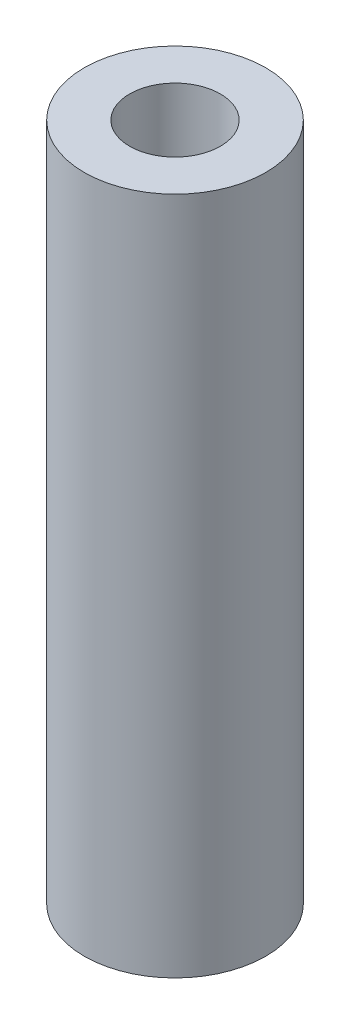
ISO-10303-21;
HEADER;
FILE_DESCRIPTION(('STEP AP214'),'2;1');
FILE_NAME('part.step','',(''),(''),'','','');
FILE_SCHEMA(('AUTOMOTIVE_DESIGN { 1 0 10303 214 1 1 1 1 }'));
ENDSEC;
DATA;
#1=APPLICATION_CONTEXT('core data for automotive mechanical design processes');
#2=APPLICATION_PROTOCOL_DEFINITION('international standard','automotive_design',2000,#1);
#3=PRODUCT_CONTEXT('',#1,'mechanical');
#4=PRODUCT('Part','Part','',(#3));
#5=PRODUCT_RELATED_PRODUCT_CATEGORY('part','',(#4));
#6=PRODUCT_DEFINITION_FORMATION('','',#4);
#7=PRODUCT_DEFINITION_CONTEXT('part definition',#1,'design');
#8=PRODUCT_DEFINITION('design','',#6,#7);
#9=PRODUCT_DEFINITION_SHAPE('','',#8);
#10=(LENGTH_UNIT() NAMED_UNIT(*) SI_UNIT(.MILLI.,.METRE.));
#11=(NAMED_UNIT(*) PLANE_ANGLE_UNIT() SI_UNIT($,.RADIAN.));
#12=(NAMED_UNIT(*) SI_UNIT($,.STERADIAN.) SOLID_ANGLE_UNIT());
#13=UNCERTAINTY_MEASURE_WITH_UNIT(LENGTH_MEASURE(1.E-05),#10,'distance_accuracy_value','');
#14=(GEOMETRIC_REPRESENTATION_CONTEXT(3) GLOBAL_UNCERTAINTY_ASSIGNED_CONTEXT((#13)) GLOBAL_UNIT_ASSIGNED_CONTEXT((#10,
#11,#12)) REPRESENTATION_CONTEXT('',''));
#15=CARTESIAN_POINT('',(0.,0.,0.));
#16=DIRECTION('',(0.,0.,1.));
#17=DIRECTION('',(1.,0.,0.));
#18=AXIS2_PLACEMENT_3D('',#15,#16,#17);
#19=CARTESIAN_POINT('',(0.,23.75,0.));
#20=DIRECTION('',(0.,1.,0.));
#21=DIRECTION('',(0.,0.,1.));
#22=AXIS2_PLACEMENT_3D('',#19,#20,#21);
#23=PLANE('',#22);
#24=CARTESIAN_POINT('',(0.,23.75,0.));
#25=DIRECTION('',(0.,1.,0.));
#26=DIRECTION('',(0.,0.,1.));
#27=AXIS2_PLACEMENT_3D('',#24,#25,#26);
#28=CIRCLE('',#27,3.175);
#29=CARTESIAN_POINT('',(0.,23.75,3.175));
#30=VERTEX_POINT('',#29);
#31=EDGE_CURVE('E10',#30,#30,#28,.T.);
#32=ORIENTED_EDGE('',*,*,#31,.T.);
#33=EDGE_LOOP('',(#32));
#34=FACE_BOUND('',#33,.T.);
#35=CARTESIAN_POINT('',(0.,23.75,0.));
#36=DIRECTION('',(0.,1.,0.));
#37=DIRECTION('',(0.,0.,1.));
#38=AXIS2_PLACEMENT_3D('',#35,#36,#37);
#39=CIRCLE('',#38,1.5875);
#40=CARTESIAN_POINT('',(0.,23.75,1.5875));
#41=VERTEX_POINT('',#40);
#42=EDGE_CURVE('E41',#41,#41,#39,.T.);
#43=ORIENTED_EDGE('',*,*,#42,.F.);
#44=EDGE_LOOP('',(#43));
#45=FACE_BOUND('',#44,.T.);
#46=ADVANCED_FACE('F30',(#34,#45),#23,.T.);
#47=CARTESIAN_POINT('',(0.,0.,0.));
#48=DIRECTION('',(0.,1.,0.));
#49=DIRECTION('',(0.,0.,1.));
#50=AXIS2_PLACEMENT_3D('',#47,#48,#49);
#51=PLANE('',#50);
#52=CARTESIAN_POINT('',(0.,0.,0.));
#53=DIRECTION('',(0.,1.,0.));
#54=DIRECTION('',(0.,0.,1.));
#55=AXIS2_PLACEMENT_3D('',#52,#53,#54);
#56=CIRCLE('',#55,3.175);
#57=CARTESIAN_POINT('',(0.,0.,3.175));
#58=VERTEX_POINT('',#57);
#59=EDGE_CURVE('E34',#58,#58,#56,.T.);
#60=ORIENTED_EDGE('',*,*,#59,.F.);
#61=EDGE_LOOP('',(#60));
#62=FACE_BOUND('',#61,.T.);
#63=CARTESIAN_POINT('',(0.,0.,0.));
#64=DIRECTION('',(0.,1.,0.));
#65=DIRECTION('',(0.,0.,1.));
#66=AXIS2_PLACEMENT_3D('',#63,#64,#65);
#67=CIRCLE('',#66,1.5875);
#68=CARTESIAN_POINT('',(0.,0.,1.5875));
#69=VERTEX_POINT('',#68);
#70=EDGE_CURVE('E43',#69,#69,#67,.T.);
#71=ORIENTED_EDGE('',*,*,#70,.T.);
#72=EDGE_LOOP('',(#71));
#73=FACE_BOUND('',#72,.T.);
#74=ADVANCED_FACE('F53',(#62,#73),#51,.F.);
#75=CARTESIAN_POINT('',(0.,23.75,0.));
#76=DIRECTION('',(0.,-1.,0.));
#77=DIRECTION('',(0.,0.,-1.));
#78=AXIS2_PLACEMENT_3D('',#75,#76,#77);
#79=CYLINDRICAL_SURFACE('',#78,3.175);
#80=ORIENTED_EDGE('',*,*,#31,.F.);
#81=EDGE_LOOP('',(#80));
#82=FACE_BOUND('',#81,.T.);
#83=ORIENTED_EDGE('',*,*,#59,.T.);
#84=EDGE_LOOP('',(#83));
#85=FACE_BOUND('',#84,.T.);
#86=ADVANCED_FACE('F32',(#82,#85),#79,.T.);
#87=CARTESIAN_POINT('',(0.,23.75,0.));
#88=DIRECTION('',(0.,-1.,0.));
#89=DIRECTION('',(0.,0.,-1.));
#90=AXIS2_PLACEMENT_3D('',#87,#88,#89);
#91=CYLINDRICAL_SURFACE('',#90,1.5875);
#92=ORIENTED_EDGE('',*,*,#42,.T.);
#93=EDGE_LOOP('',(#92));
#94=FACE_BOUND('',#93,.T.);
#95=ORIENTED_EDGE('',*,*,#70,.F.);
#96=EDGE_LOOP('',(#95));
#97=FACE_BOUND('',#96,.T.);
#98=ADVANCED_FACE('F49',(#94,#97),#91,.F.);
#99=CLOSED_SHELL('',(#46,#74,#86,#98));
#100=MANIFOLD_SOLID_BREP('B2',#99);
#101=ADVANCED_BREP_SHAPE_REPRESENTATION('',(#18,#100),#14);
#102=SHAPE_DEFINITION_REPRESENTATION(#9,#101);
ENDSEC;
END-ISO-10303-21;
